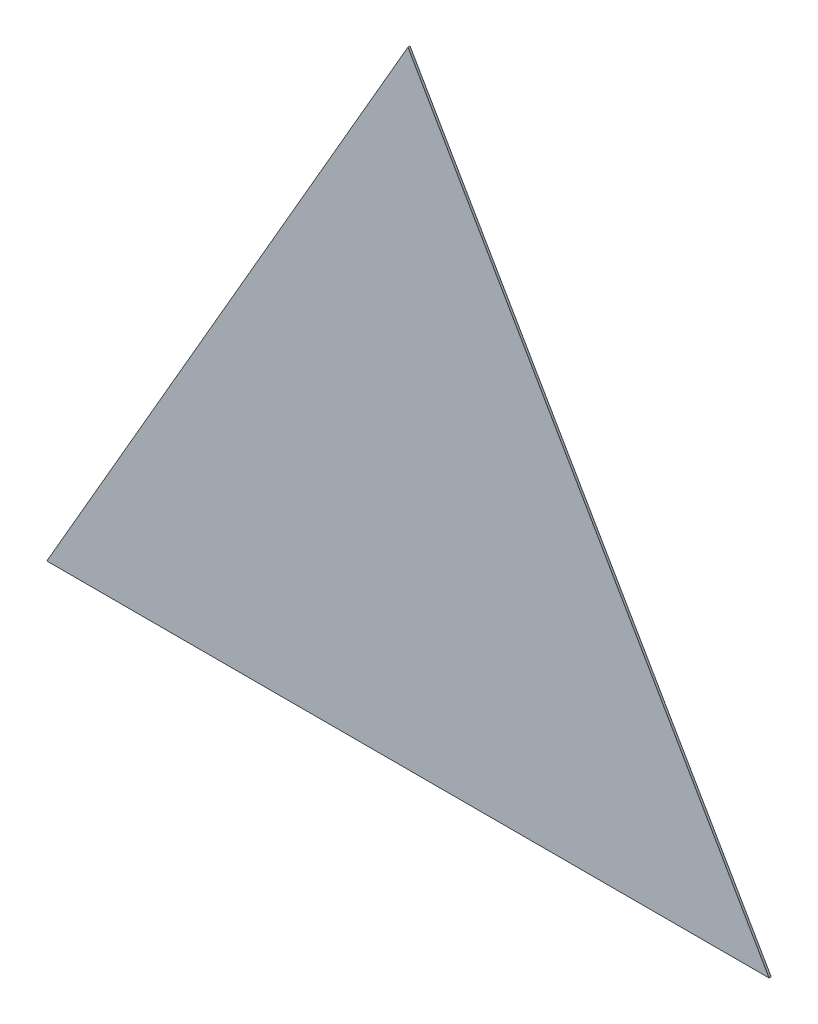
ISO-10303-21;
HEADER;
FILE_DESCRIPTION(('STEP AP214'),'2;1');
FILE_NAME('part.step','',(''),(''),'','','');
FILE_SCHEMA(('AUTOMOTIVE_DESIGN { 1 0 10303 214 1 1 1 1 }'));
ENDSEC;
DATA;
#1=APPLICATION_CONTEXT('core data for automotive mechanical design processes');
#2=APPLICATION_PROTOCOL_DEFINITION('international standard','automotive_design',2000,#1);
#3=PRODUCT_CONTEXT('',#1,'mechanical');
#4=PRODUCT('Part','Part','',(#3));
#5=PRODUCT_RELATED_PRODUCT_CATEGORY('part','',(#4));
#6=PRODUCT_DEFINITION_FORMATION('','',#4);
#7=PRODUCT_DEFINITION_CONTEXT('part definition',#1,'design');
#8=PRODUCT_DEFINITION('design','',#6,#7);
#9=PRODUCT_DEFINITION_SHAPE('','',#8);
#10=(LENGTH_UNIT() NAMED_UNIT(*) SI_UNIT(.MILLI.,.METRE.));
#11=(NAMED_UNIT(*) PLANE_ANGLE_UNIT() SI_UNIT($,.RADIAN.));
#12=(NAMED_UNIT(*) SI_UNIT($,.STERADIAN.) SOLID_ANGLE_UNIT());
#13=UNCERTAINTY_MEASURE_WITH_UNIT(LENGTH_MEASURE(1.E-05),#10,'distance_accuracy_value','');
#14=(GEOMETRIC_REPRESENTATION_CONTEXT(3) GLOBAL_UNCERTAINTY_ASSIGNED_CONTEXT((#13)) GLOBAL_UNIT_ASSIGNED_CONTEXT((#10,
#11,#12)) REPRESENTATION_CONTEXT('',''));
#15=CARTESIAN_POINT('',(0.,0.,0.));
#16=DIRECTION('',(0.,0.,1.));
#17=DIRECTION('',(1.,0.,0.));
#18=AXIS2_PLACEMENT_3D('',#15,#16,#17);
#19=CARTESIAN_POINT('',(346.410161513775,-200.,2.));
#20=DIRECTION('',(-0.866025403784439,-0.5,0.));
#21=DIRECTION('',(0.5,-0.866025403784439,0.));
#22=AXIS2_PLACEMENT_3D('',#19,#20,#21);
#23=PLANE('',#22);
#24=DIRECTION('',(-0.5,0.866025403784438,0.));
#25=VECTOR('',#24,1.);
#26=CARTESIAN_POINT('',(346.410161513775,-200.,0.));
#27=LINE('',#26,#25);
#28=CARTESIAN_POINT('',(346.410161513775,-200.,0.));
#29=VERTEX_POINT('',#28);
#30=CARTESIAN_POINT('',(0.,400.,0.));
#31=VERTEX_POINT('',#30);
#32=EDGE_CURVE('E84',#29,#31,#27,.T.);
#33=ORIENTED_EDGE('',*,*,#32,.T.);
#34=DIRECTION('',(0.,0.,-1.));
#35=VECTOR('',#34,1.);
#36=CARTESIAN_POINT('',(0.,400.,2.));
#37=LINE('',#36,#35);
#38=CARTESIAN_POINT('',(0.,400.,2.));
#39=VERTEX_POINT('',#38);
#40=EDGE_CURVE('E11',#39,#31,#37,.T.);
#41=ORIENTED_EDGE('',*,*,#40,.F.);
#42=DIRECTION('',(-0.5,0.866025403784438,0.));
#43=VECTOR('',#42,1.);
#44=CARTESIAN_POINT('',(346.410161513775,-200.,2.));
#45=LINE('',#44,#43);
#46=CARTESIAN_POINT('',(346.410161513775,-200.,2.));
#47=VERTEX_POINT('',#46);
#48=EDGE_CURVE('E77',#47,#39,#45,.T.);
#49=ORIENTED_EDGE('',*,*,#48,.F.);
#50=DIRECTION('',(0.,0.,-1.));
#51=VECTOR('',#50,1.);
#52=CARTESIAN_POINT('',(346.410161513775,-200.,2.));
#53=LINE('',#52,#51);
#54=EDGE_CURVE('E85',#47,#29,#53,.T.);
#55=ORIENTED_EDGE('',*,*,#54,.T.);
#56=EDGE_LOOP('',(#33,#41,#49,#55));
#57=FACE_BOUND('',#56,.T.);
#58=ADVANCED_FACE('F37',(#57),#23,.F.);
#59=CARTESIAN_POINT('',(0.,400.,2.));
#60=DIRECTION('',(0.866025403784439,-0.5,0.));
#61=DIRECTION('',(0.5,0.866025403784439,0.));
#62=AXIS2_PLACEMENT_3D('',#59,#60,#61);
#63=PLANE('',#62);
#64=DIRECTION('',(-0.5,-0.866025403784439,0.));
#65=VECTOR('',#64,1.);
#66=CARTESIAN_POINT('',(0.,400.,0.));
#67=LINE('',#66,#65);
#68=CARTESIAN_POINT('',(-346.410161513776,-200.,0.));
#69=VERTEX_POINT('',#68);
#70=EDGE_CURVE('E65',#31,#69,#67,.T.);
#71=ORIENTED_EDGE('',*,*,#70,.T.);
#72=DIRECTION('',(0.,0.,-1.));
#73=VECTOR('',#72,1.);
#74=CARTESIAN_POINT('',(-346.410161513776,-200.,2.));
#75=LINE('',#74,#73);
#76=CARTESIAN_POINT('',(-346.410161513776,-200.,2.));
#77=VERTEX_POINT('',#76);
#78=EDGE_CURVE('E45',#77,#69,#75,.T.);
#79=ORIENTED_EDGE('',*,*,#78,.F.);
#80=DIRECTION('',(-0.5,-0.866025403784439,0.));
#81=VECTOR('',#80,1.);
#82=CARTESIAN_POINT('',(0.,400.,2.));
#83=LINE('',#82,#81);
#84=EDGE_CURVE('E73',#39,#77,#83,.T.);
#85=ORIENTED_EDGE('',*,*,#84,.F.);
#86=ORIENTED_EDGE('',*,*,#40,.T.);
#87=EDGE_LOOP('',(#71,#79,#85,#86));
#88=FACE_BOUND('',#87,.T.);
#89=ADVANCED_FACE('F74',(#88),#63,.F.);
#90=CARTESIAN_POINT('',(-346.410161513776,-200.,2.));
#91=DIRECTION('',(0.,1.,0.));
#92=DIRECTION('',(-1.,0.,0.));
#93=AXIS2_PLACEMENT_3D('',#90,#91,#92);
#94=PLANE('',#93);
#95=DIRECTION('',(1.,0.,0.));
#96=VECTOR('',#95,1.);
#97=CARTESIAN_POINT('',(-346.410161513776,-200.,0.));
#98=LINE('',#97,#96);
#99=EDGE_CURVE('E70',#69,#29,#98,.T.);
#100=ORIENTED_EDGE('',*,*,#99,.T.);
#101=ORIENTED_EDGE('',*,*,#54,.F.);
#102=DIRECTION('',(1.,0.,0.));
#103=VECTOR('',#102,1.);
#104=CARTESIAN_POINT('',(-346.410161513776,-200.,2.));
#105=LINE('',#104,#103);
#106=EDGE_CURVE('E53',#77,#47,#105,.T.);
#107=ORIENTED_EDGE('',*,*,#106,.F.);
#108=ORIENTED_EDGE('',*,*,#78,.T.);
#109=EDGE_LOOP('',(#100,#101,#107,#108));
#110=FACE_BOUND('',#109,.T.);
#111=ADVANCED_FACE('F92',(#110),#94,.F.);
#112=CARTESIAN_POINT('',(0.,0.,2.));
#113=DIRECTION('',(0.,0.,1.));
#114=DIRECTION('',(1.,0.,0.));
#115=AXIS2_PLACEMENT_3D('',#112,#113,#114);
#116=PLANE('',#115);
#117=ORIENTED_EDGE('',*,*,#48,.T.);
#118=ORIENTED_EDGE('',*,*,#84,.T.);
#119=ORIENTED_EDGE('',*,*,#106,.T.);
#120=EDGE_LOOP('',(#117,#118,#119));
#121=FACE_BOUND('',#120,.T.);
#122=ADVANCED_FACE('F80',(#121),#116,.T.);
#123=CARTESIAN_POINT('',(0.,0.,0.));
#124=DIRECTION('',(0.,0.,1.));
#125=DIRECTION('',(1.,0.,0.));
#126=AXIS2_PLACEMENT_3D('',#123,#124,#125);
#127=PLANE('',#126);
#128=ORIENTED_EDGE('',*,*,#32,.F.);
#129=ORIENTED_EDGE('',*,*,#99,.F.);
#130=ORIENTED_EDGE('',*,*,#70,.F.);
#131=EDGE_LOOP('',(#128,#129,#130));
#132=FACE_BOUND('',#131,.T.);
#133=ADVANCED_FACE('F93',(#132),#127,.F.);
#134=CLOSED_SHELL('',(#58,#89,#111,#122,#133));
#135=MANIFOLD_SOLID_BREP('B2',#134);
#136=ADVANCED_BREP_SHAPE_REPRESENTATION('',(#18,#135),#14);
#137=SHAPE_DEFINITION_REPRESENTATION(#9,#136);
ENDSEC;
END-ISO-10303-21;
